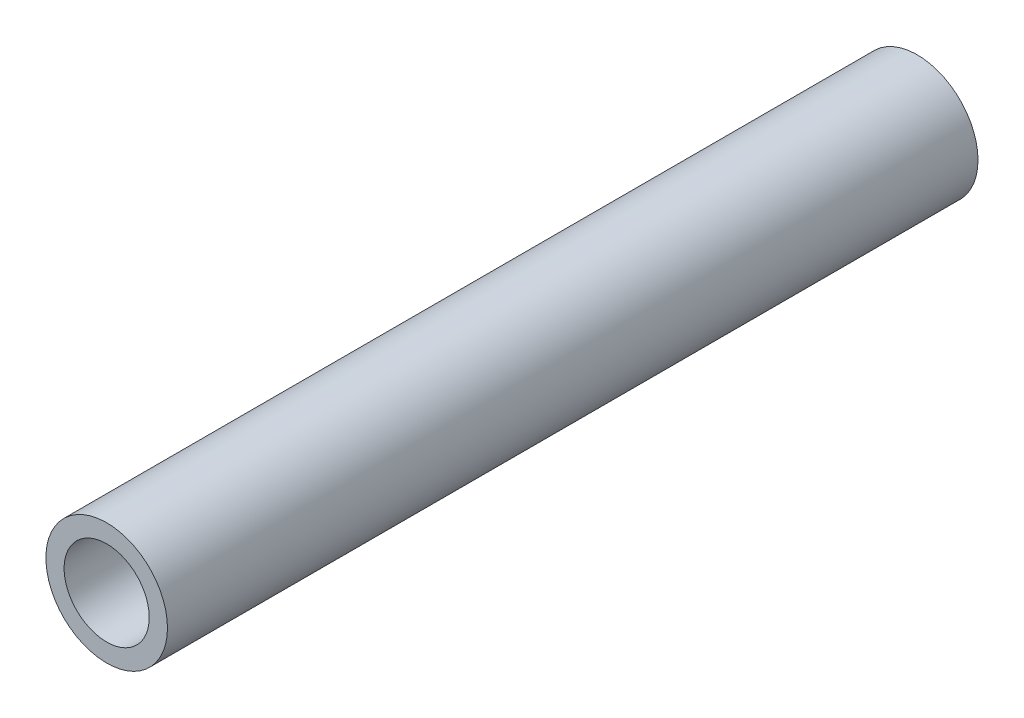
ISO-10303-21;
HEADER;
FILE_DESCRIPTION(('STEP AP214'),'2;1');
FILE_NAME('part.step','',(''),(''),'','','');
FILE_SCHEMA(('AUTOMOTIVE_DESIGN { 1 0 10303 214 1 1 1 1 }'));
ENDSEC;
DATA;
#1=APPLICATION_CONTEXT('core data for automotive mechanical design processes');
#2=APPLICATION_PROTOCOL_DEFINITION('international standard','automotive_design',2000,#1);
#3=PRODUCT_CONTEXT('',#1,'mechanical');
#4=PRODUCT('Part','Part','',(#3));
#5=PRODUCT_RELATED_PRODUCT_CATEGORY('part','',(#4));
#6=PRODUCT_DEFINITION_FORMATION('','',#4);
#7=PRODUCT_DEFINITION_CONTEXT('part definition',#1,'design');
#8=PRODUCT_DEFINITION('design','',#6,#7);
#9=PRODUCT_DEFINITION_SHAPE('','',#8);
#10=(LENGTH_UNIT() NAMED_UNIT(*) SI_UNIT(.MILLI.,.METRE.));
#11=(NAMED_UNIT(*) PLANE_ANGLE_UNIT() SI_UNIT($,.RADIAN.));
#12=(NAMED_UNIT(*) SI_UNIT($,.STERADIAN.) SOLID_ANGLE_UNIT());
#13=UNCERTAINTY_MEASURE_WITH_UNIT(LENGTH_MEASURE(1.E-05),#10,'distance_accuracy_value','');
#14=(GEOMETRIC_REPRESENTATION_CONTEXT(3) GLOBAL_UNCERTAINTY_ASSIGNED_CONTEXT((#13)) GLOBAL_UNIT_ASSIGNED_CONTEXT((#10,
#11,#12)) REPRESENTATION_CONTEXT('',''));
#15=CARTESIAN_POINT('',(0.,0.,0.));
#16=DIRECTION('',(0.,0.,1.));
#17=DIRECTION('',(1.,0.,0.));
#18=AXIS2_PLACEMENT_3D('',#15,#16,#17);
#19=CARTESIAN_POINT('',(0.,0.,0.));
#20=DIRECTION('',(0.,0.,1.));
#21=DIRECTION('',(-1.,0.,0.));
#22=AXIS2_PLACEMENT_3D('',#19,#20,#21);
#23=CYLINDRICAL_SURFACE('',#22,2.1);
#24=CARTESIAN_POINT('',(0.,0.,0.));
#25=DIRECTION('',(0.,0.,1.));
#26=DIRECTION('',(-1.,0.,0.));
#27=AXIS2_PLACEMENT_3D('',#24,#25,#26);
#28=CIRCLE('',#27,2.1);
#29=CARTESIAN_POINT('',(2.1,0.,0.));
#30=VERTEX_POINT('',#29);
#31=EDGE_CURVE('E38',#30,#30,#28,.T.);
#32=ORIENTED_EDGE('',*,*,#31,.F.);
#33=DIRECTION('',(0.,0.,1.));
#34=VECTOR('',#33,1.);
#35=CARTESIAN_POINT('',(2.1,0.,0.));
#36=LINE('',#35,#34);
#37=CARTESIAN_POINT('',(2.1,0.,40.));
#38=VERTEX_POINT('',#37);
#39=EDGE_CURVE('E10',#30,#38,#36,.T.);
#40=ORIENTED_EDGE('',*,*,#39,.T.);
#41=CARTESIAN_POINT('',(0.,0.,40.));
#42=DIRECTION('',(0.,0.,-1.));
#43=DIRECTION('',(-1.,0.,0.));
#44=AXIS2_PLACEMENT_3D('',#41,#42,#43);
#45=CIRCLE('',#44,2.1);
#46=EDGE_CURVE('E59',#38,#38,#45,.T.);
#47=ORIENTED_EDGE('',*,*,#46,.F.);
#48=ORIENTED_EDGE('',*,*,#39,.F.);
#49=EDGE_LOOP('',(#32,#40,#47,#48));
#50=FACE_BOUND('',#49,.T.);
#51=ADVANCED_FACE('F16',(#50),#23,.F.);
#52=CARTESIAN_POINT('',(0.,0.,0.));
#53=DIRECTION('',(0.,0.,1.));
#54=DIRECTION('',(-1.,0.,0.));
#55=AXIS2_PLACEMENT_3D('',#52,#53,#54);
#56=CYLINDRICAL_SURFACE('',#55,3.);
#57=CARTESIAN_POINT('',(0.,0.,40.));
#58=DIRECTION('',(0.,0.,1.));
#59=DIRECTION('',(-1.,0.,0.));
#60=AXIS2_PLACEMENT_3D('',#57,#58,#59);
#61=CIRCLE('',#60,3.);
#62=CARTESIAN_POINT('',(3.,0.,40.));
#63=VERTEX_POINT('',#62);
#64=EDGE_CURVE('E55',#63,#63,#61,.T.);
#65=ORIENTED_EDGE('',*,*,#64,.F.);
#66=DIRECTION('',(0.,0.,-1.));
#67=VECTOR('',#66,1.);
#68=CARTESIAN_POINT('',(3.,0.,0.));
#69=LINE('',#68,#67);
#70=CARTESIAN_POINT('',(3.,0.,0.));
#71=VERTEX_POINT('',#70);
#72=EDGE_CURVE('E26',#63,#71,#69,.T.);
#73=ORIENTED_EDGE('',*,*,#72,.T.);
#74=CARTESIAN_POINT('',(0.,0.,0.));
#75=DIRECTION('',(0.,0.,-1.));
#76=DIRECTION('',(-1.,0.,0.));
#77=AXIS2_PLACEMENT_3D('',#74,#75,#76);
#78=CIRCLE('',#77,3.);
#79=EDGE_CURVE('E49',#71,#71,#78,.T.);
#80=ORIENTED_EDGE('',*,*,#79,.F.);
#81=ORIENTED_EDGE('',*,*,#72,.F.);
#82=EDGE_LOOP('',(#65,#73,#80,#81));
#83=FACE_BOUND('',#82,.T.);
#84=ADVANCED_FACE('F56',(#83),#56,.T.);
#85=CARTESIAN_POINT('',(0.,0.,0.));
#86=DIRECTION('',(0.,0.,1.));
#87=DIRECTION('',(1.,0.,0.));
#88=AXIS2_PLACEMENT_3D('',#85,#86,#87);
#89=PLANE('',#88);
#90=ORIENTED_EDGE('',*,*,#79,.T.);
#91=EDGE_LOOP('',(#90));
#92=FACE_BOUND('',#91,.T.);
#93=ORIENTED_EDGE('',*,*,#31,.T.);
#94=EDGE_LOOP('',(#93));
#95=FACE_BOUND('',#94,.T.);
#96=ADVANCED_FACE('F93',(#92,#95),#89,.F.);
#97=CARTESIAN_POINT('',(0.,0.,40.));
#98=DIRECTION('',(0.,0.,1.));
#99=DIRECTION('',(1.,0.,0.));
#100=AXIS2_PLACEMENT_3D('',#97,#98,#99);
#101=PLANE('',#100);
#102=ORIENTED_EDGE('',*,*,#64,.T.);
#103=EDGE_LOOP('',(#102));
#104=FACE_BOUND('',#103,.T.);
#105=ORIENTED_EDGE('',*,*,#46,.T.);
#106=EDGE_LOOP('',(#105));
#107=FACE_BOUND('',#106,.T.);
#108=ADVANCED_FACE('F18',(#104,#107),#101,.T.);
#109=CLOSED_SHELL('',(#51,#84,#96,#108));
#110=MANIFOLD_SOLID_BREP('B1',#109);
#111=ADVANCED_BREP_SHAPE_REPRESENTATION('',(#18,#110),#14);
#112=SHAPE_DEFINITION_REPRESENTATION(#9,#111);
ENDSEC;
END-ISO-10303-21;
